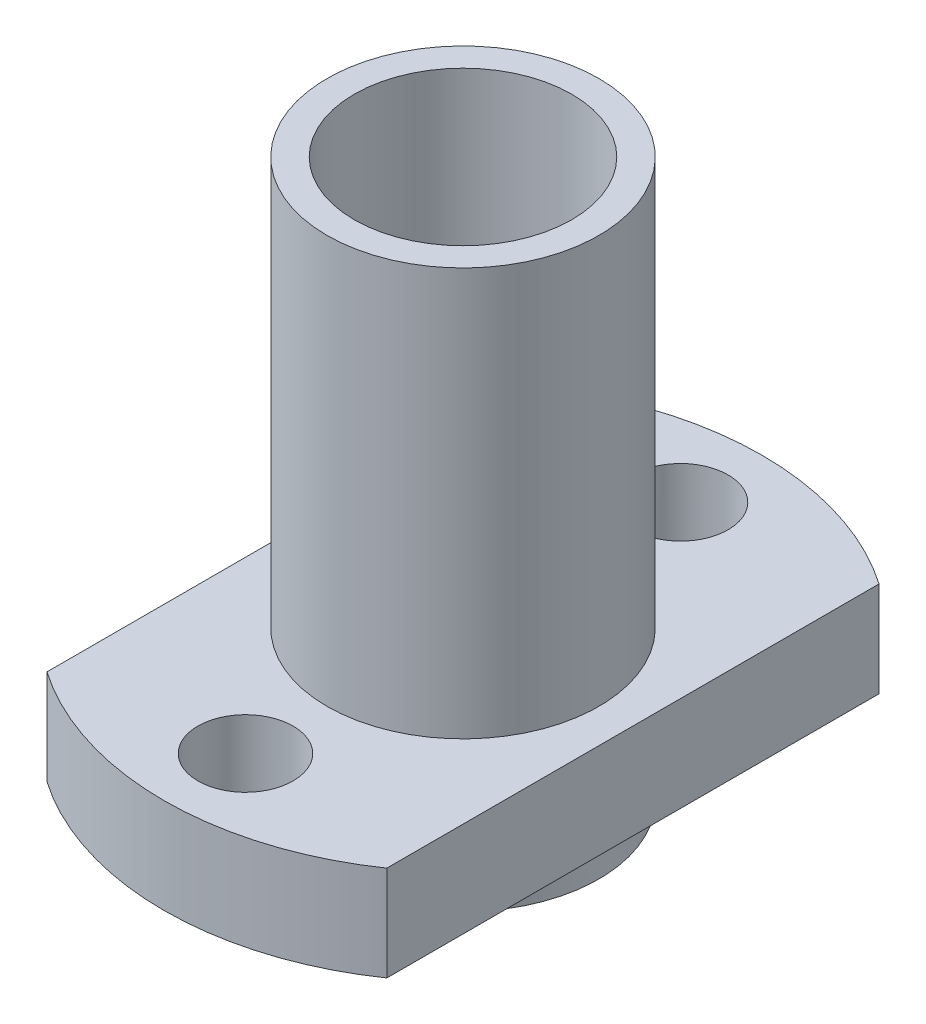
ISO-10303-21;
HEADER;
FILE_DESCRIPTION(('STEP AP214'),'2;1');
FILE_NAME('part.step','',(''),(''),'','','');
FILE_SCHEMA(('AUTOMOTIVE_DESIGN { 1 0 10303 214 1 1 1 1 }'));
ENDSEC;
DATA;
#1=APPLICATION_CONTEXT('core data for automotive mechanical design processes');
#2=APPLICATION_PROTOCOL_DEFINITION('international standard','automotive_design',2000,#1);
#3=PRODUCT_CONTEXT('',#1,'mechanical');
#4=PRODUCT('Part','Part','',(#3));
#5=PRODUCT_RELATED_PRODUCT_CATEGORY('part','',(#4));
#6=PRODUCT_DEFINITION_FORMATION('','',#4);
#7=PRODUCT_DEFINITION_CONTEXT('part definition',#1,'design');
#8=PRODUCT_DEFINITION('design','',#6,#7);
#9=PRODUCT_DEFINITION_SHAPE('','',#8);
#10=(LENGTH_UNIT() NAMED_UNIT(*) SI_UNIT(.MILLI.,.METRE.));
#11=(NAMED_UNIT(*) PLANE_ANGLE_UNIT() SI_UNIT($,.RADIAN.));
#12=(NAMED_UNIT(*) SI_UNIT($,.STERADIAN.) SOLID_ANGLE_UNIT());
#13=UNCERTAINTY_MEASURE_WITH_UNIT(LENGTH_MEASURE(1.E-05),#10,'distance_accuracy_value','');
#14=(GEOMETRIC_REPRESENTATION_CONTEXT(3) GLOBAL_UNCERTAINTY_ASSIGNED_CONTEXT((#13)) GLOBAL_UNIT_ASSIGNED_CONTEXT((#10,
#11,#12)) REPRESENTATION_CONTEXT('',''));
#15=CARTESIAN_POINT('',(0.,0.,0.));
#16=DIRECTION('',(0.,0.,1.));
#17=DIRECTION('',(1.,0.,0.));
#18=AXIS2_PLACEMENT_3D('',#15,#16,#17);
#19=CARTESIAN_POINT('',(0.,5.,0.));
#20=DIRECTION('',(0.,-1.,0.));
#21=DIRECTION('',(0.,0.,-1.));
#22=AXIS2_PLACEMENT_3D('',#19,#20,#21);
#23=CYLINDRICAL_SURFACE('',#22,11.);
#24=DIRECTION('',(0.,-1.,0.));
#25=VECTOR('',#24,1.);
#26=CARTESIAN_POINT('',(6.25000000000003,11.5,-9.05193349511582));
#27=LINE('',#26,#25);
#28=CARTESIAN_POINT('',(6.25000000000003,5.,-9.05193349511582));
#29=VERTEX_POINT('',#28);
#30=CARTESIAN_POINT('',(6.25000000000003,1.5,-9.05193349511582));
#31=VERTEX_POINT('',#30);
#32=EDGE_CURVE('E84',#29,#31,#27,.T.);
#33=ORIENTED_EDGE('',*,*,#32,.T.);
#34=CARTESIAN_POINT('',(0.,1.5,0.));
#35=DIRECTION('',(0.,-1.,0.));
#36=DIRECTION('',(0.,0.,-1.));
#37=AXIS2_PLACEMENT_3D('',#34,#35,#36);
#38=CIRCLE('',#37,11.);
#39=CARTESIAN_POINT('',(-6.25,1.5,-9.05193349511583));
#40=VERTEX_POINT('',#39);
#41=EDGE_CURVE('E94',#40,#31,#38,.T.);
#42=ORIENTED_EDGE('',*,*,#41,.F.);
#43=DIRECTION('',(0.,-1.,0.));
#44=VECTOR('',#43,1.);
#45=CARTESIAN_POINT('',(-6.25,11.5,-9.05193349511583));
#46=LINE('',#45,#44);
#47=CARTESIAN_POINT('',(-6.25,5.,-9.05193349511583));
#48=VERTEX_POINT('',#47);
#49=EDGE_CURVE('E160',#48,#40,#46,.T.);
#50=ORIENTED_EDGE('',*,*,#49,.F.);
#51=CARTESIAN_POINT('',(0.,5.,0.));
#52=DIRECTION('',(0.,-1.,0.));
#53=DIRECTION('',(0.,0.,-1.));
#54=AXIS2_PLACEMENT_3D('',#51,#52,#53);
#55=CIRCLE('',#54,11.);
#56=EDGE_CURVE('E42',#48,#29,#55,.T.);
#57=ORIENTED_EDGE('',*,*,#56,.T.);
#58=EDGE_LOOP('',(#33,#42,#50,#57));
#59=FACE_BOUND('',#58,.T.);
#60=ADVANCED_FACE('F33',(#59),#23,.T.);
#61=DIRECTION('',(0.,-1.,0.));
#62=VECTOR('',#61,1.);
#63=CARTESIAN_POINT('',(6.25000000000003,11.5,9.05193349511582));
#64=LINE('',#63,#62);
#65=CARTESIAN_POINT('',(6.25000000000003,5.,9.05193349511582));
#66=VERTEX_POINT('',#65);
#67=CARTESIAN_POINT('',(6.25000000000003,1.5,9.05193349511582));
#68=VERTEX_POINT('',#67);
#69=EDGE_CURVE('E76',#66,#68,#64,.T.);
#70=ORIENTED_EDGE('',*,*,#69,.F.);
#71=CARTESIAN_POINT('',(-6.25,5.,9.05193349511583));
#72=VERTEX_POINT('',#71);
#73=EDGE_CURVE('E50',#66,#72,#55,.T.);
#74=ORIENTED_EDGE('',*,*,#73,.T.);
#75=DIRECTION('',(0.,-1.,0.));
#76=VECTOR('',#75,1.);
#77=CARTESIAN_POINT('',(-6.25,11.5,9.05193349511583));
#78=LINE('',#77,#76);
#79=CARTESIAN_POINT('',(-6.25,1.5,9.05193349511583));
#80=VERTEX_POINT('',#79);
#81=EDGE_CURVE('E96',#72,#80,#78,.T.);
#82=ORIENTED_EDGE('',*,*,#81,.T.);
#83=EDGE_CURVE('E91',#68,#80,#38,.T.);
#84=ORIENTED_EDGE('',*,*,#83,.F.);
#85=EDGE_LOOP('',(#70,#74,#82,#84));
#86=FACE_BOUND('',#85,.T.);
#87=ADVANCED_FACE('F35',(#86),#23,.T.);
#88=CARTESIAN_POINT('',(0.,5.,0.));
#89=DIRECTION('',(0.,-1.,0.));
#90=DIRECTION('',(0.,0.,-1.));
#91=AXIS2_PLACEMENT_3D('',#88,#89,#90);
#92=PLANE('',#91);
#93=CARTESIAN_POINT('',(0.,5.,8.00000000000003));
#94=DIRECTION('',(0.,1.,0.));
#95=DIRECTION('',(0.,0.,1.));
#96=AXIS2_PLACEMENT_3D('',#93,#94,#95);
#97=CIRCLE('',#96,1.75);
#98=CARTESIAN_POINT('',(0.,5.,9.75000000000003));
#99=VERTEX_POINT('',#98);
#100=EDGE_CURVE('E111',#99,#99,#97,.T.);
#101=ORIENTED_EDGE('',*,*,#100,.F.);
#102=EDGE_LOOP('',(#101));
#103=FACE_BOUND('',#102,.T.);
#104=ORIENTED_EDGE('',*,*,#73,.F.);
#105=DIRECTION('',(0.,0.,-1.));
#106=VECTOR('',#105,1.);
#107=CARTESIAN_POINT('',(6.25000000000003,5.,0.));
#108=LINE('',#107,#106);
#109=EDGE_CURVE('E82',#66,#29,#108,.T.);
#110=ORIENTED_EDGE('',*,*,#109,.T.);
#111=ORIENTED_EDGE('',*,*,#56,.F.);
#112=DIRECTION('',(0.,0.,1.));
#113=VECTOR('',#112,1.);
#114=CARTESIAN_POINT('',(-6.25,5.,0.));
#115=LINE('',#114,#113);
#116=EDGE_CURVE('E57',#48,#72,#115,.T.);
#117=ORIENTED_EDGE('',*,*,#116,.T.);
#118=EDGE_LOOP('',(#104,#110,#111,#117));
#119=FACE_BOUND('',#118,.T.);
#120=CARTESIAN_POINT('',(0.,5.,-8.));
#121=DIRECTION('',(0.,1.,0.));
#122=DIRECTION('',(0.,0.,1.));
#123=AXIS2_PLACEMENT_3D('',#120,#121,#122);
#124=CIRCLE('',#123,1.75);
#125=CARTESIAN_POINT('',(0.,5.,-6.25));
#126=VERTEX_POINT('',#125);
#127=EDGE_CURVE('E105',#126,#126,#124,.T.);
#128=ORIENTED_EDGE('',*,*,#127,.F.);
#129=EDGE_LOOP('',(#128));
#130=FACE_BOUND('',#129,.T.);
#131=CARTESIAN_POINT('',(0.,5.,0.));
#132=DIRECTION('',(0.,-1.,0.));
#133=DIRECTION('',(0.,0.,-1.));
#134=AXIS2_PLACEMENT_3D('',#131,#132,#133);
#135=CIRCLE('',#134,5.);
#136=CARTESIAN_POINT('',(0.,5.,-5.));
#137=VERTEX_POINT('',#136);
#138=EDGE_CURVE('E97',#137,#137,#135,.T.);
#139=ORIENTED_EDGE('',*,*,#138,.T.);
#140=EDGE_LOOP('',(#139));
#141=FACE_BOUND('',#140,.T.);
#142=ADVANCED_FACE('F152',(#103,#119,#130,#141),#92,.F.);
#143=CARTESIAN_POINT('',(0.,1.5,0.));
#144=DIRECTION('',(0.,-1.,0.));
#145=DIRECTION('',(0.,0.,-1.));
#146=AXIS2_PLACEMENT_3D('',#143,#144,#145);
#147=PLANE('',#146);
#148=DIRECTION('',(0.,0.,-1.));
#149=VECTOR('',#148,1.);
#150=CARTESIAN_POINT('',(6.25000000000003,1.5,9.05193349511582));
#151=LINE('',#150,#149);
#152=EDGE_CURVE('E80',#68,#31,#151,.T.);
#153=ORIENTED_EDGE('',*,*,#152,.F.);
#154=ORIENTED_EDGE('',*,*,#83,.T.);
#155=DIRECTION('',(0.,0.,1.));
#156=VECTOR('',#155,1.);
#157=CARTESIAN_POINT('',(-6.25,1.5,-9.05193349511583));
#158=LINE('',#157,#156);
#159=EDGE_CURVE('E156',#40,#80,#158,.T.);
#160=ORIENTED_EDGE('',*,*,#159,.F.);
#161=ORIENTED_EDGE('',*,*,#41,.T.);
#162=EDGE_LOOP('',(#153,#154,#160,#161));
#163=FACE_BOUND('',#162,.T.);
#164=CARTESIAN_POINT('',(0.,1.5,8.00000000000003));
#165=DIRECTION('',(0.,-1.,0.));
#166=DIRECTION('',(0.,0.,-1.));
#167=AXIS2_PLACEMENT_3D('',#164,#165,#166);
#168=CIRCLE('',#167,1.75);
#169=CARTESIAN_POINT('',(0.,1.5,6.25000000000003));
#170=VERTEX_POINT('',#169);
#171=EDGE_CURVE('E37',#170,#170,#168,.T.);
#172=ORIENTED_EDGE('',*,*,#171,.F.);
#173=EDGE_LOOP('',(#172));
#174=FACE_BOUND('',#173,.T.);
#175=CARTESIAN_POINT('',(0.,1.5,-8.));
#176=DIRECTION('',(0.,-1.,0.));
#177=DIRECTION('',(0.,0.,-1.));
#178=AXIS2_PLACEMENT_3D('',#175,#176,#177);
#179=CIRCLE('',#178,1.75);
#180=CARTESIAN_POINT('',(0.,1.5,-9.75));
#181=VERTEX_POINT('',#180);
#182=EDGE_CURVE('E103',#181,#181,#179,.T.);
#183=ORIENTED_EDGE('',*,*,#182,.F.);
#184=EDGE_LOOP('',(#183));
#185=FACE_BOUND('',#184,.T.);
#186=CARTESIAN_POINT('',(0.,1.5,0.));
#187=DIRECTION('',(0.,-1.,0.));
#188=DIRECTION('',(0.,0.,-1.));
#189=AXIS2_PLACEMENT_3D('',#186,#187,#188);
#190=CIRCLE('',#189,5.);
#191=CARTESIAN_POINT('',(0.,1.5,-5.));
#192=VERTEX_POINT('',#191);
#193=EDGE_CURVE('E11',#192,#192,#190,.T.);
#194=ORIENTED_EDGE('',*,*,#193,.F.);
#195=EDGE_LOOP('',(#194));
#196=FACE_BOUND('',#195,.T.);
#197=ADVANCED_FACE('F88',(#163,#174,#185,#196),#147,.T.);
#198=CARTESIAN_POINT('',(0.,-0.5,0.));
#199=DIRECTION('',(0.,1.,0.));
#200=DIRECTION('',(0.,0.,1.));
#201=AXIS2_PLACEMENT_3D('',#198,#199,#200);
#202=CYLINDRICAL_SURFACE('',#201,5.);
#203=ORIENTED_EDGE('',*,*,#193,.T.);
#204=EDGE_LOOP('',(#203));
#205=FACE_BOUND('',#204,.T.);
#206=CARTESIAN_POINT('',(0.,-0.5,0.));
#207=DIRECTION('',(0.,1.,0.));
#208=DIRECTION('',(0.,0.,1.));
#209=AXIS2_PLACEMENT_3D('',#206,#207,#208);
#210=CIRCLE('',#209,5.);
#211=CARTESIAN_POINT('',(0.,-0.5,5.));
#212=VERTEX_POINT('',#211);
#213=EDGE_CURVE('E100',#212,#212,#210,.T.);
#214=ORIENTED_EDGE('',*,*,#213,.T.);
#215=EDGE_LOOP('',(#214));
#216=FACE_BOUND('',#215,.T.);
#217=ADVANCED_FACE('F130',(#205,#216),#202,.T.);
#218=CARTESIAN_POINT('',(0.,-0.5,0.));
#219=DIRECTION('',(0.,1.,0.));
#220=DIRECTION('',(0.,0.,1.));
#221=AXIS2_PLACEMENT_3D('',#218,#219,#220);
#222=PLANE('',#221);
#223=CARTESIAN_POINT('',(0.,-0.5,0.));
#224=DIRECTION('',(0.,1.,0.));
#225=DIRECTION('',(0.,0.,1.));
#226=AXIS2_PLACEMENT_3D('',#223,#224,#225);
#227=CIRCLE('',#226,4.);
#228=CARTESIAN_POINT('',(0.,-0.5,4.));
#229=VERTEX_POINT('',#228);
#230=EDGE_CURVE('E124',#229,#229,#227,.T.);
#231=ORIENTED_EDGE('',*,*,#230,.T.);
#232=EDGE_LOOP('',(#231));
#233=FACE_BOUND('',#232,.T.);
#234=ORIENTED_EDGE('',*,*,#213,.F.);
#235=EDGE_LOOP('',(#234));
#236=FACE_BOUND('',#235,.T.);
#237=ADVANCED_FACE('F132',(#233,#236),#222,.F.);
#238=CARTESIAN_POINT('',(0.,20.,0.));
#239=DIRECTION('',(0.,1.,0.));
#240=DIRECTION('',(0.,0.,1.));
#241=AXIS2_PLACEMENT_3D('',#238,#239,#240);
#242=CIRCLE('',#241,5.);
#243=CARTESIAN_POINT('',(0.,20.,5.));
#244=VERTEX_POINT('',#243);
#245=EDGE_CURVE('E121',#244,#244,#242,.T.);
#246=ORIENTED_EDGE('',*,*,#245,.F.);
#247=EDGE_LOOP('',(#246));
#248=FACE_BOUND('',#247,.T.);
#249=ORIENTED_EDGE('',*,*,#138,.F.);
#250=EDGE_LOOP('',(#249));
#251=FACE_BOUND('',#250,.T.);
#252=ADVANCED_FACE('F134',(#248,#251),#202,.T.);
#253=CARTESIAN_POINT('',(0.,-0.5,0.));
#254=DIRECTION('',(0.,1.,0.));
#255=DIRECTION('',(0.,0.,1.));
#256=AXIS2_PLACEMENT_3D('',#253,#254,#255);
#257=CYLINDRICAL_SURFACE('',#256,4.);
#258=CARTESIAN_POINT('',(0.,20.,0.));
#259=DIRECTION('',(0.,1.,0.));
#260=DIRECTION('',(0.,0.,1.));
#261=AXIS2_PLACEMENT_3D('',#258,#259,#260);
#262=CIRCLE('',#261,4.);
#263=CARTESIAN_POINT('',(0.,20.,4.));
#264=VERTEX_POINT('',#263);
#265=EDGE_CURVE('E109',#264,#264,#262,.T.);
#266=ORIENTED_EDGE('',*,*,#265,.T.);
#267=EDGE_LOOP('',(#266));
#268=FACE_BOUND('',#267,.T.);
#269=ORIENTED_EDGE('',*,*,#230,.F.);
#270=EDGE_LOOP('',(#269));
#271=FACE_BOUND('',#270,.T.);
#272=ADVANCED_FACE('F141',(#268,#271),#257,.F.);
#273=CARTESIAN_POINT('',(0.,20.,0.));
#274=DIRECTION('',(0.,1.,0.));
#275=DIRECTION('',(0.,0.,1.));
#276=AXIS2_PLACEMENT_3D('',#273,#274,#275);
#277=PLANE('',#276);
#278=ORIENTED_EDGE('',*,*,#245,.T.);
#279=EDGE_LOOP('',(#278));
#280=FACE_BOUND('',#279,.T.);
#281=ORIENTED_EDGE('',*,*,#265,.F.);
#282=EDGE_LOOP('',(#281));
#283=FACE_BOUND('',#282,.T.);
#284=ADVANCED_FACE('F180',(#280,#283),#277,.T.);
#285=CARTESIAN_POINT('',(0.,-0.5,-8.));
#286=DIRECTION('',(0.,1.,0.));
#287=DIRECTION('',(0.,0.,1.));
#288=AXIS2_PLACEMENT_3D('',#285,#286,#287);
#289=CYLINDRICAL_SURFACE('',#288,1.75);
#290=ORIENTED_EDGE('',*,*,#182,.T.);
#291=EDGE_LOOP('',(#290));
#292=FACE_BOUND('',#291,.T.);
#293=ORIENTED_EDGE('',*,*,#127,.T.);
#294=EDGE_LOOP('',(#293));
#295=FACE_BOUND('',#294,.T.);
#296=ADVANCED_FACE('F174',(#292,#295),#289,.F.);
#297=CARTESIAN_POINT('',(0.,-0.5,8.00000000000003));
#298=DIRECTION('',(0.,1.,0.));
#299=DIRECTION('',(0.,0.,1.));
#300=AXIS2_PLACEMENT_3D('',#297,#298,#299);
#301=CYLINDRICAL_SURFACE('',#300,1.75);
#302=ORIENTED_EDGE('',*,*,#171,.T.);
#303=EDGE_LOOP('',(#302));
#304=FACE_BOUND('',#303,.T.);
#305=ORIENTED_EDGE('',*,*,#100,.T.);
#306=EDGE_LOOP('',(#305));
#307=FACE_BOUND('',#306,.T.);
#308=ADVANCED_FACE('F166',(#304,#307),#301,.F.);
#309=CARTESIAN_POINT('',(-6.25,11.5,-9.05193349511583));
#310=DIRECTION('',(1.,0.,0.));
#311=DIRECTION('',(0.,0.,-1.));
#312=AXIS2_PLACEMENT_3D('',#309,#310,#311);
#313=PLANE('',#312);
#314=ORIENTED_EDGE('',*,*,#49,.T.);
#315=ORIENTED_EDGE('',*,*,#159,.T.);
#316=ORIENTED_EDGE('',*,*,#81,.F.);
#317=ORIENTED_EDGE('',*,*,#116,.F.);
#318=EDGE_LOOP('',(#314,#315,#316,#317));
#319=FACE_BOUND('',#318,.T.);
#320=ADVANCED_FACE('F164',(#319),#313,.F.);
#321=CARTESIAN_POINT('',(6.25000000000003,11.5,9.05193349511582));
#322=DIRECTION('',(-1.,0.,0.));
#323=DIRECTION('',(0.,0.,1.));
#324=AXIS2_PLACEMENT_3D('',#321,#322,#323);
#325=PLANE('',#324);
#326=ORIENTED_EDGE('',*,*,#69,.T.);
#327=ORIENTED_EDGE('',*,*,#152,.T.);
#328=ORIENTED_EDGE('',*,*,#32,.F.);
#329=ORIENTED_EDGE('',*,*,#109,.F.);
#330=EDGE_LOOP('',(#326,#327,#328,#329));
#331=FACE_BOUND('',#330,.T.);
#332=ADVANCED_FACE('F78',(#331),#325,.F.);
#333=CLOSED_SHELL('',(#60,#87,#142,#197,#217,#237,#252,#272,#284,#296,#308,#320,#332));
#334=MANIFOLD_SOLID_BREP('B2',#333);
#335=ADVANCED_BREP_SHAPE_REPRESENTATION('',(#18,#334),#14);
#336=SHAPE_DEFINITION_REPRESENTATION(#9,#335);
ENDSEC;
END-ISO-10303-21;
